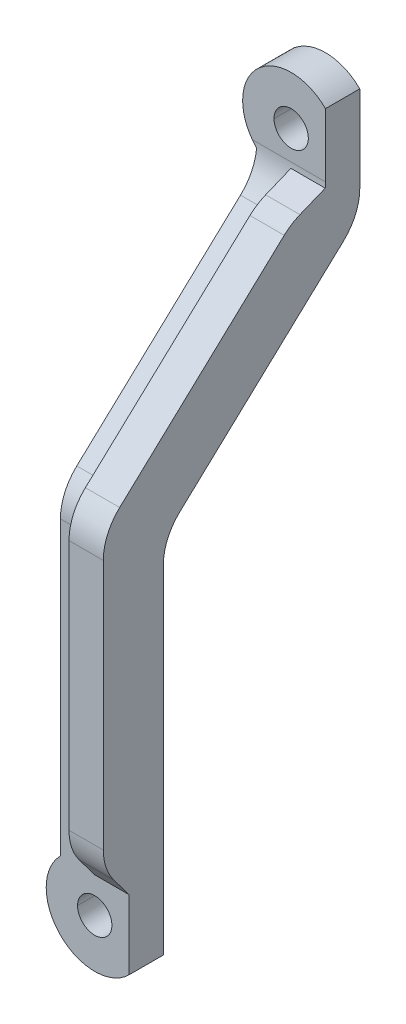
ISO-10303-21;
HEADER;
FILE_DESCRIPTION(('STEP AP214'),'2;1');
FILE_NAME('part.step','',(''),(''),'','','');
FILE_SCHEMA(('AUTOMOTIVE_DESIGN { 1 0 10303 214 1 1 1 1 }'));
ENDSEC;
DATA;
#1=APPLICATION_CONTEXT('core data for automotive mechanical design processes');
#2=APPLICATION_PROTOCOL_DEFINITION('international standard','automotive_design',2000,#1);
#3=PRODUCT_CONTEXT('',#1,'mechanical');
#4=PRODUCT('Part','Part','',(#3));
#5=PRODUCT_RELATED_PRODUCT_CATEGORY('part','',(#4));
#6=PRODUCT_DEFINITION_FORMATION('','',#4);
#7=PRODUCT_DEFINITION_CONTEXT('part definition',#1,'design');
#8=PRODUCT_DEFINITION('design','',#6,#7);
#9=PRODUCT_DEFINITION_SHAPE('','',#8);
#10=(LENGTH_UNIT() NAMED_UNIT(*) SI_UNIT(.MILLI.,.METRE.));
#11=(NAMED_UNIT(*) PLANE_ANGLE_UNIT() SI_UNIT($,.RADIAN.));
#12=(NAMED_UNIT(*) SI_UNIT($,.STERADIAN.) SOLID_ANGLE_UNIT());
#13=UNCERTAINTY_MEASURE_WITH_UNIT(LENGTH_MEASURE(1.E-05),#10,'distance_accuracy_value','');
#14=(GEOMETRIC_REPRESENTATION_CONTEXT(3) GLOBAL_UNCERTAINTY_ASSIGNED_CONTEXT((#13)) GLOBAL_UNIT_ASSIGNED_CONTEXT((#10,
#11,#12)) REPRESENTATION_CONTEXT('',''));
#15=CARTESIAN_POINT('',(0.,0.,0.));
#16=DIRECTION('',(0.,0.,1.));
#17=DIRECTION('',(1.,0.,0.));
#18=AXIS2_PLACEMENT_3D('',#15,#16,#17);
#19=CARTESIAN_POINT('',(2.,30.6154164817218,-9.0922660270173));
#20=DIRECTION('',(1.,0.,0.));
#21=DIRECTION('',(0.,1.,0.));
#22=AXIS2_PLACEMENT_3D('',#19,#20,#21);
#23=CYLINDRICAL_SURFACE('',#22,3.);
#24=CARTESIAN_POINT('',(2.,30.6154164817218,-9.0922660270173));
#25=DIRECTION('',(-1.,0.,0.));
#26=DIRECTION('',(0.,1.,0.));
#27=AXIS2_PLACEMENT_3D('',#24,#25,#26);
#28=CIRCLE('',#27,3.);
#29=CARTESIAN_POINT('',(2.,32.8094775865793,-7.04627094682981));
#30=VERTEX_POINT('',#29);
#31=CARTESIAN_POINT('',(2.,33.394070033702,-7.9612998745319));
#32=VERTEX_POINT('',#31);
#33=EDGE_CURVE('E9',#30,#32,#28,.T.);
#34=ORIENTED_EDGE('',*,*,#33,.F.);
#35=DIRECTION('',(-1.,0.,0.));
#36=VECTOR('',#35,1.);
#37=CARTESIAN_POINT('',(2.,32.8094775865793,-7.0462709468298));
#38=LINE('',#37,#36);
#39=CARTESIAN_POINT('',(4.,32.8094775865793,-7.04627094682981));
#40=VERTEX_POINT('',#39);
#41=EDGE_CURVE('E227',#40,#30,#38,.T.);
#42=ORIENTED_EDGE('',*,*,#41,.F.);
#43=CARTESIAN_POINT('',(4.,30.6154164817218,-9.0922660270173));
#44=DIRECTION('',(1.,0.,0.));
#45=DIRECTION('',(0.,1.,0.));
#46=AXIS2_PLACEMENT_3D('',#43,#44,#45);
#47=CIRCLE('',#46,3.);
#48=CARTESIAN_POINT('',(4.,33.394070033702,-7.9612998745319));
#49=VERTEX_POINT('',#48);
#50=EDGE_CURVE('E230',#49,#40,#47,.T.);
#51=ORIENTED_EDGE('',*,*,#50,.F.);
#52=DIRECTION('',(1.,0.,0.));
#53=VECTOR('',#52,1.);
#54=CARTESIAN_POINT('',(2.,33.394070033702,-7.9612998745319));
#55=LINE('',#54,#53);
#56=EDGE_CURVE('E418',#32,#49,#55,.T.);
#57=ORIENTED_EDGE('',*,*,#56,.F.);
#58=EDGE_LOOP('',(#34,#42,#51,#57));
#59=FACE_BOUND('',#58,.T.);
#60=ADVANCED_FACE('F14',(#59),#23,.T.);
#61=CARTESIAN_POINT('',(2.,21.6704837012824,0.5));
#62=DIRECTION('',(1.,0.,0.));
#63=DIRECTION('',(0.,1.,0.));
#64=AXIS2_PLACEMENT_3D('',#61,#62,#63);
#65=CYLINDRICAL_SURFACE('',#64,3.);
#66=CARTESIAN_POINT('',(2.,21.6704837012824,0.5));
#67=DIRECTION('',(-1.,0.,0.));
#68=DIRECTION('',(0.,1.,0.));
#69=AXIS2_PLACEMENT_3D('',#66,#67,#68);
#70=CIRCLE('',#69,3.);
#71=CARTESIAN_POINT('',(2.,21.6704837012824,3.5));
#72=VERTEX_POINT('',#71);
#73=CARTESIAN_POINT('',(2.,23.8645448061399,2.54599508018749));
#74=VERTEX_POINT('',#73);
#75=EDGE_CURVE('E25',#72,#74,#70,.T.);
#76=ORIENTED_EDGE('',*,*,#75,.F.);
#77=DIRECTION('',(-1.,0.,0.));
#78=VECTOR('',#77,1.);
#79=CARTESIAN_POINT('',(2.,21.6704837012824,3.5));
#80=LINE('',#79,#78);
#81=CARTESIAN_POINT('',(4.,21.6704837012824,3.5));
#82=VERTEX_POINT('',#81);
#83=EDGE_CURVE('E401',#82,#72,#80,.T.);
#84=ORIENTED_EDGE('',*,*,#83,.F.);
#85=CARTESIAN_POINT('',(4.,21.6704837012824,0.5));
#86=DIRECTION('',(1.,0.,0.));
#87=DIRECTION('',(0.,1.,0.));
#88=AXIS2_PLACEMENT_3D('',#85,#86,#87);
#89=CIRCLE('',#88,3.);
#90=CARTESIAN_POINT('',(4.,23.8645448061399,2.54599508018749));
#91=VERTEX_POINT('',#90);
#92=EDGE_CURVE('E246',#91,#82,#89,.T.);
#93=ORIENTED_EDGE('',*,*,#92,.F.);
#94=DIRECTION('',(1.,0.,0.));
#95=VECTOR('',#94,1.);
#96=CARTESIAN_POINT('',(2.,23.8645448061399,2.54599508018749));
#97=LINE('',#96,#95);
#98=EDGE_CURVE('E236',#74,#91,#97,.T.);
#99=ORIENTED_EDGE('',*,*,#98,.F.);
#100=EDGE_LOOP('',(#76,#84,#93,#99));
#101=FACE_BOUND('',#100,.T.);
#102=ADVANCED_FACE('F806',(#101),#65,.T.);
#103=CARTESIAN_POINT('',(2.,7.04848459707165,0.5));
#104=DIRECTION('',(1.,0.,0.));
#105=DIRECTION('',(0.,1.,0.));
#106=AXIS2_PLACEMENT_3D('',#103,#104,#105);
#107=CYLINDRICAL_SURFACE('',#106,3.);
#108=CARTESIAN_POINT('',(2.,7.04848459707165,0.5));
#109=DIRECTION('',(-1.,0.,0.));
#110=DIRECTION('',(0.,1.,0.));
#111=AXIS2_PLACEMENT_3D('',#108,#109,#110);
#112=CIRCLE('',#111,3.);
#113=CARTESIAN_POINT('',(2.,5.24848459707165,2.9));
#114=VERTEX_POINT('',#113);
#115=CARTESIAN_POINT('',(2.,7.04848459707165,3.5));
#116=VERTEX_POINT('',#115);
#117=EDGE_CURVE('E302',#114,#116,#112,.T.);
#118=ORIENTED_EDGE('',*,*,#117,.F.);
#119=DIRECTION('',(-1.,0.,0.));
#120=VECTOR('',#119,1.);
#121=CARTESIAN_POINT('',(2.,5.24848459707165,2.9));
#122=LINE('',#121,#120);
#123=CARTESIAN_POINT('',(4.,5.24848459707165,2.9));
#124=VERTEX_POINT('',#123);
#125=EDGE_CURVE('E337',#124,#114,#122,.T.);
#126=ORIENTED_EDGE('',*,*,#125,.F.);
#127=CARTESIAN_POINT('',(4.,7.04848459707165,0.5));
#128=DIRECTION('',(1.,0.,0.));
#129=DIRECTION('',(0.,1.,0.));
#130=AXIS2_PLACEMENT_3D('',#127,#128,#129);
#131=CIRCLE('',#130,3.);
#132=CARTESIAN_POINT('',(4.,7.04848459707165,3.5));
#133=VERTEX_POINT('',#132);
#134=EDGE_CURVE('E387',#133,#124,#131,.T.);
#135=ORIENTED_EDGE('',*,*,#134,.F.);
#136=DIRECTION('',(1.,0.,0.));
#137=VECTOR('',#136,1.);
#138=CARTESIAN_POINT('',(2.,7.04848459707165,3.5));
#139=LINE('',#138,#137);
#140=EDGE_CURVE('E470',#116,#133,#139,.T.);
#141=ORIENTED_EDGE('',*,*,#140,.F.);
#142=EDGE_LOOP('',(#118,#126,#135,#141));
#143=FACE_BOUND('',#142,.T.);
#144=ADVANCED_FACE('F810',(#143),#107,.T.);
#145=CARTESIAN_POINT('',(0.,34.3044371248828,-6.45));
#146=DIRECTION('',(-1.,0.,0.));
#147=DIRECTION('',(0.,0.,1.));
#148=AXIS2_PLACEMENT_3D('',#145,#146,#147);
#149=CYLINDRICAL_SURFACE('',#148,3.);
#150=CARTESIAN_POINT('',(4.,34.3044371248828,-6.45));
#151=DIRECTION('',(-1.,0.,0.));
#152=DIRECTION('',(0.,1.,0.));
#153=AXIS2_PLACEMENT_3D('',#150,#151,#152);
#154=CIRCLE('',#153,3.);
#155=CARTESIAN_POINT('',(4.,34.3044371248828,-9.45));
#156=VERTEX_POINT('',#155);
#157=CARTESIAN_POINT('',(4.,33.9934203426467,-9.43383453984425));
#158=VERTEX_POINT('',#157);
#159=EDGE_CURVE('E260',#156,#158,#154,.T.);
#160=ORIENTED_EDGE('',*,*,#159,.F.);
#161=DIRECTION('',(1.,0.,0.));
#162=VECTOR('',#161,1.);
#163=CARTESIAN_POINT('',(2.,34.3044371248828,-9.45));
#164=LINE('',#163,#162);
#165=CARTESIAN_POINT('',(-0.263860979946466,34.3044371248828,-9.45));
#166=VERTEX_POINT('',#165);
#167=EDGE_CURVE('E406',#166,#156,#164,.T.);
#168=ORIENTED_EDGE('',*,*,#167,.F.);
#169=CARTESIAN_POINT('',(0.,34.,-9.43451303180152));
#170=CARTESIAN_POINT('',(-0.0950755922492341,34.0950755922493,-9.44421127725814));
#171=CARTESIAN_POINT('',(-0.18303359615477,34.1965190034362,-9.45));
#172=CARTESIAN_POINT('',(-0.263860979946466,34.3044371248828,-9.45));
#173=(BOUNDED_CURVE() B_SPLINE_CURVE(3,(#169,#170,#171,#172),.UNSPECIFIED.,.F.,
.F.) B_SPLINE_CURVE_WITH_KNOTS((4,4),(0.,0.000403167987232583),
.UNSPECIFIED.) CURVE() GEOMETRIC_REPRESENTATION_ITEM() RATIONAL_B_SPLINE_CURVE((1.,1.,1.,1.)) REPRESENTATION_ITEM(''));
#174=CARTESIAN_POINT('',(0.,34.,-9.43451303180152));
#175=VERTEX_POINT('',#174);
#176=EDGE_CURVE('E391',#175,#166,#173,.T.);
#177=ORIENTED_EDGE('',*,*,#176,.F.);
#178=CARTESIAN_POINT('',(0.,34.3044371248828,-6.45));
#179=DIRECTION('',(1.,0.,0.));
#180=DIRECTION('',(0.,-1.,0.));
#181=AXIS2_PLACEMENT_3D('',#178,#179,#180);
#182=CIRCLE('',#181,3.);
#183=CARTESIAN_POINT('',(0.,32.1103760200253,-8.4959950801875));
#184=VERTEX_POINT('',#183);
#185=EDGE_CURVE('E374',#184,#175,#182,.T.);
#186=ORIENTED_EDGE('',*,*,#185,.F.);
#187=DIRECTION('',(-1.,0.,0.));
#188=VECTOR('',#187,1.);
#189=CARTESIAN_POINT('',(0.,32.1103760200253,-8.49599508018749));
#190=LINE('',#189,#188);
#191=CARTESIAN_POINT('',(2.,32.1103760200253,-8.49599508018747));
#192=VERTEX_POINT('',#191);
#193=EDGE_CURVE('E410',#192,#184,#190,.T.);
#194=ORIENTED_EDGE('',*,*,#193,.F.);
#195=CARTESIAN_POINT('',(2.,34.3044371248828,-6.45));
#196=DIRECTION('',(-1.,0.,0.));
#197=DIRECTION('',(0.,1.,0.));
#198=AXIS2_PLACEMENT_3D('',#195,#196,#197);
#199=CIRCLE('',#198,3.);
#200=CARTESIAN_POINT('',(2.,33.9934203426467,-9.43383453984425));
#201=VERTEX_POINT('',#200);
#202=EDGE_CURVE('E414',#201,#192,#199,.T.);
#203=ORIENTED_EDGE('',*,*,#202,.F.);
#204=DIRECTION('',(-1.,0.,0.));
#205=VECTOR('',#204,1.);
#206=CARTESIAN_POINT('',(4.,33.9934203426467,-9.43383453984425));
#207=LINE('',#206,#205);
#208=EDGE_CURVE('E235',#158,#201,#207,.T.);
#209=ORIENTED_EDGE('',*,*,#208,.F.);
#210=EDGE_LOOP('',(#160,#168,#177,#186,#194,#203,#209));
#211=FACE_BOUND('',#210,.T.);
#212=ADVANCED_FACE('F869',(#211),#149,.F.);
#213=CARTESIAN_POINT('',(0.,21.0182651388409,-1.));
#214=DIRECTION('',(1.,0.,0.));
#215=DIRECTION('',(0.,0.,-1.));
#216=AXIS2_PLACEMENT_3D('',#213,#214,#215);
#217=CYLINDRICAL_SURFACE('',#216,3.);
#218=CARTESIAN_POINT('',(2.,21.0182651388409,-1.));
#219=DIRECTION('',(1.,0.,0.));
#220=DIRECTION('',(0.,1.,0.));
#221=AXIS2_PLACEMENT_3D('',#218,#219,#220);
#222=CIRCLE('',#221,3.);
#223=CARTESIAN_POINT('',(2.,23.2123262436985,1.04599508018749));
#224=VERTEX_POINT('',#223);
#225=CARTESIAN_POINT('',(2.,21.0182651388409,2.));
#226=VERTEX_POINT('',#225);
#227=EDGE_CURVE('E306',#224,#226,#222,.T.);
#228=ORIENTED_EDGE('',*,*,#227,.F.);
#229=DIRECTION('',(1.,0.,0.));
#230=VECTOR('',#229,1.);
#231=CARTESIAN_POINT('',(0.,23.2123262436985,1.04599508018749));
#232=LINE('',#231,#230);
#233=CARTESIAN_POINT('',(0.,23.2123262436985,1.04599508018749));
#234=VERTEX_POINT('',#233);
#235=EDGE_CURVE('E279',#234,#224,#232,.T.);
#236=ORIENTED_EDGE('',*,*,#235,.F.);
#237=CARTESIAN_POINT('',(0.,21.0182651388409,-1.));
#238=DIRECTION('',(-1.,0.,0.));
#239=DIRECTION('',(0.,-1.,0.));
#240=AXIS2_PLACEMENT_3D('',#237,#238,#239);
#241=CIRCLE('',#240,3.);
#242=CARTESIAN_POINT('',(0.,21.0182651388409,2.));
#243=VERTEX_POINT('',#242);
#244=EDGE_CURVE('E378',#243,#234,#241,.T.);
#245=ORIENTED_EDGE('',*,*,#244,.F.);
#246=DIRECTION('',(-1.,0.,0.));
#247=VECTOR('',#246,1.);
#248=CARTESIAN_POINT('',(0.,21.0182651388409,2.));
#249=LINE('',#248,#247);
#250=EDGE_CURVE('E264',#226,#243,#249,.T.);
#251=ORIENTED_EDGE('',*,*,#250,.F.);
#252=EDGE_LOOP('',(#228,#236,#245,#251));
#253=FACE_BOUND('',#252,.T.);
#254=ADVANCED_FACE('F16',(#253),#217,.T.);
#255=CARTESIAN_POINT('',(0.,32.9817348611591,-8.45));
#256=DIRECTION('',(-1.,0.,0.));
#257=DIRECTION('',(0.,0.,1.));
#258=AXIS2_PLACEMENT_3D('',#255,#256,#257);
#259=CYLINDRICAL_SURFACE('',#258,3.);
#260=CARTESIAN_POINT('',(4.,32.9817348611591,-8.45));
#261=DIRECTION('',(1.,0.,0.));
#262=DIRECTION('',(0.,1.,0.));
#263=AXIS2_PLACEMENT_3D('',#260,#261,#262);
#264=CIRCLE('',#263,3.);
#265=CARTESIAN_POINT('',(4.,30.7876737563015,-10.4959950801875));
#266=VERTEX_POINT('',#265);
#267=CARTESIAN_POINT('',(4.,32.9817348611591,-11.45));
#268=VERTEX_POINT('',#267);
#269=EDGE_CURVE('E348',#266,#268,#264,.T.);
#270=ORIENTED_EDGE('',*,*,#269,.F.);
#271=DIRECTION('',(1.,0.,0.));
#272=VECTOR('',#271,1.);
#273=CARTESIAN_POINT('',(4.,30.7876737563015,-10.4959950801875));
#274=LINE('',#273,#272);
#275=CARTESIAN_POINT('',(0.,30.7876737563015,-10.4959950801875));
#276=VERTEX_POINT('',#275);
#277=EDGE_CURVE('E342',#276,#266,#274,.T.);
#278=ORIENTED_EDGE('',*,*,#277,.F.);
#279=CARTESIAN_POINT('',(0.,32.9817348611591,-8.45));
#280=DIRECTION('',(-1.,0.,0.));
#281=DIRECTION('',(0.,-1.,0.));
#282=AXIS2_PLACEMENT_3D('',#279,#280,#281);
#283=CIRCLE('',#282,3.);
#284=CARTESIAN_POINT('',(0.,32.9817348611591,-11.45));
#285=VERTEX_POINT('',#284);
#286=EDGE_CURVE('E358',#285,#276,#283,.T.);
#287=ORIENTED_EDGE('',*,*,#286,.F.);
#288=DIRECTION('',(-1.,0.,0.));
#289=VECTOR('',#288,1.);
#290=CARTESIAN_POINT('',(0.,32.9817348611591,-11.45));
#291=LINE('',#290,#289);
#292=EDGE_CURVE('E208',#268,#285,#291,.T.);
#293=ORIENTED_EDGE('',*,*,#292,.F.);
#294=EDGE_LOOP('',(#270,#278,#287,#293));
#295=FACE_BOUND('',#294,.T.);
#296=ADVANCED_FACE('F557',(#295),#259,.T.);
#297=CARTESIAN_POINT('',(0.,19.6955628751173,-3.));
#298=DIRECTION('',(1.,0.,0.));
#299=DIRECTION('',(0.,0.,-1.));
#300=AXIS2_PLACEMENT_3D('',#297,#298,#299);
#301=CYLINDRICAL_SURFACE('',#300,3.);
#302=CARTESIAN_POINT('',(4.,19.6955628751173,-3.));
#303=DIRECTION('',(-1.,0.,0.));
#304=DIRECTION('',(0.,1.,0.));
#305=AXIS2_PLACEMENT_3D('',#302,#303,#304);
#306=CIRCLE('',#305,3.);
#307=CARTESIAN_POINT('',(4.,19.6955628751173,0.));
#308=VERTEX_POINT('',#307);
#309=CARTESIAN_POINT('',(4.,21.8896239799747,-0.954004919812507));
#310=VERTEX_POINT('',#309);
#311=EDGE_CURVE('E277',#308,#310,#306,.T.);
#312=ORIENTED_EDGE('',*,*,#311,.F.);
#313=DIRECTION('',(1.,0.,0.));
#314=VECTOR('',#313,1.);
#315=CARTESIAN_POINT('',(0.,19.6955628751173,0.));
#316=LINE('',#315,#314);
#317=CARTESIAN_POINT('',(0.,19.6955628751173,0.));
#318=VERTEX_POINT('',#317);
#319=EDGE_CURVE('E350',#318,#308,#316,.T.);
#320=ORIENTED_EDGE('',*,*,#319,.F.);
#321=CARTESIAN_POINT('',(0.,19.6955628751173,-3.));
#322=DIRECTION('',(1.,0.,0.));
#323=DIRECTION('',(0.,-1.,0.));
#324=AXIS2_PLACEMENT_3D('',#321,#322,#323);
#325=CIRCLE('',#324,3.);
#326=CARTESIAN_POINT('',(0.,21.8896239799747,-0.954004919812507));
#327=VERTEX_POINT('',#326);
#328=EDGE_CURVE('E296',#327,#318,#325,.T.);
#329=ORIENTED_EDGE('',*,*,#328,.F.);
#330=DIRECTION('',(-1.,0.,0.));
#331=VECTOR('',#330,1.);
#332=CARTESIAN_POINT('',(0.,21.8896239799747,-0.954004919812507));
#333=LINE('',#332,#331);
#334=EDGE_CURVE('E402',#310,#327,#333,.T.);
#335=ORIENTED_EDGE('',*,*,#334,.F.);
#336=EDGE_LOOP('',(#312,#320,#329,#335));
#337=FACE_BOUND('',#336,.T.);
#338=ADVANCED_FACE('F552',(#337),#301,.F.);
#339=CARTESIAN_POINT('',(2.,0.,0.));
#340=DIRECTION('',(1.,0.,0.));
#341=DIRECTION('',(0.,-1.,0.));
#342=AXIS2_PLACEMENT_3D('',#339,#340,#341);
#343=PLANE('',#342);
#344=DIRECTION('',(0.,-0.376988717495132,0.926217850660078));
#345=VECTOR('',#344,1.);
#346=CARTESIAN_POINT('',(2.,33.1859610193725,-7.45));
#347=LINE('',#346,#345);
#348=EDGE_CURVE('E421',#201,#32,#347,.T.);
#349=ORIENTED_EDGE('',*,*,#348,.F.);
#350=ORIENTED_EDGE('',*,*,#202,.T.);
#351=DIRECTION('',(0.,0.681998360062499,-0.73135370161917));
#352=VECTOR('',#351,1.);
#353=CARTESIAN_POINT('',(2.,33.,-9.45));
#354=LINE('',#353,#352);
#355=EDGE_CURVE('E283',#224,#192,#354,.T.);
#356=ORIENTED_EDGE('',*,*,#355,.F.);
#357=ORIENTED_EDGE('',*,*,#227,.T.);
#358=DIRECTION('',(0.,1.,0.));
#359=VECTOR('',#358,1.);
#360=CARTESIAN_POINT('',(2.,22.3227022637238,2.));
#361=LINE('',#360,#359);
#362=CARTESIAN_POINT('',(2.,4.04848459707165,2.));
#363=VERTEX_POINT('',#362);
#364=EDGE_CURVE('E271',#363,#226,#361,.T.);
#365=ORIENTED_EDGE('',*,*,#364,.F.);
#366=DIRECTION('',(0.,-0.8,-0.6));
#367=VECTOR('',#366,1.);
#368=CARTESIAN_POINT('',(2.,4.04848459707165,2.));
#369=LINE('',#368,#367);
#370=EDGE_CURVE('E341',#114,#363,#369,.T.);
#371=ORIENTED_EDGE('',*,*,#370,.F.);
#372=ORIENTED_EDGE('',*,*,#117,.T.);
#373=DIRECTION('',(0.,-1.,0.));
#374=VECTOR('',#373,1.);
#375=CARTESIAN_POINT('',(2.,6.04848459707165,3.5));
#376=LINE('',#375,#374);
#377=EDGE_CURVE('E473',#72,#116,#376,.T.);
#378=ORIENTED_EDGE('',*,*,#377,.F.);
#379=ORIENTED_EDGE('',*,*,#75,.T.);
#380=DIRECTION('',(0.,-0.681998360062499,0.73135370161917));
#381=VECTOR('',#380,1.);
#382=CARTESIAN_POINT('',(2.,22.9749208261651,3.5));
#383=LINE('',#382,#381);
#384=EDGE_CURVE('E398',#30,#74,#383,.T.);
#385=ORIENTED_EDGE('',*,*,#384,.F.);
#386=ORIENTED_EDGE('',*,*,#33,.T.);
#387=EDGE_LOOP('',(#349,#350,#356,#357,#365,#371,#372,#378,#379,#385,#386));
#388=FACE_BOUND('',#387,.T.);
#389=ADVANCED_FACE('F921',(#388),#343,.F.);
#390=CARTESIAN_POINT('',(2.,33.1859610193725,-7.45));
#391=DIRECTION('',(0.,0.926217850660078,0.376988717495132));
#392=DIRECTION('',(1.,0.,0.));
#393=AXIS2_PLACEMENT_3D('',#390,#391,#392);
#394=PLANE('',#393);
#395=DIRECTION('',(0.,-0.376988717495132,0.926217850660078));
#396=VECTOR('',#395,1.);
#397=CARTESIAN_POINT('',(4.,33.1859610193725,-7.45));
#398=LINE('',#397,#396);
#399=EDGE_CURVE('E252',#158,#49,#398,.T.);
#400=ORIENTED_EDGE('',*,*,#399,.F.);
#401=ORIENTED_EDGE('',*,*,#208,.T.);
#402=ORIENTED_EDGE('',*,*,#348,.T.);
#403=ORIENTED_EDGE('',*,*,#56,.T.);
#404=EDGE_LOOP('',(#400,#401,#402,#403));
#405=FACE_BOUND('',#404,.T.);
#406=ADVANCED_FACE('F913',(#405),#394,.T.);
#407=CARTESIAN_POINT('',(2.,22.9749208261651,3.5));
#408=DIRECTION('',(0.,0.73135370161917,0.681998360062499));
#409=DIRECTION('',(1.,0.,0.));
#410=AXIS2_PLACEMENT_3D('',#407,#408,#409);
#411=PLANE('',#410);
#412=ORIENTED_EDGE('',*,*,#384,.T.);
#413=ORIENTED_EDGE('',*,*,#98,.T.);
#414=DIRECTION('',(0.,-0.681998360062499,0.73135370161917));
#415=VECTOR('',#414,1.);
#416=CARTESIAN_POINT('',(4.,22.9749208261651,3.5));
#417=LINE('',#416,#415);
#418=EDGE_CURVE('E239',#40,#91,#417,.T.);
#419=ORIENTED_EDGE('',*,*,#418,.F.);
#420=ORIENTED_EDGE('',*,*,#41,.T.);
#421=EDGE_LOOP('',(#412,#413,#419,#420));
#422=FACE_BOUND('',#421,.T.);
#423=ADVANCED_FACE('F240',(#422),#411,.T.);
#424=CARTESIAN_POINT('',(2.,6.04848459707165,3.5));
#425=DIRECTION('',(0.,0.,1.));
#426=DIRECTION('',(1.,0.,0.));
#427=AXIS2_PLACEMENT_3D('',#424,#425,#426);
#428=PLANE('',#427);
#429=ORIENTED_EDGE('',*,*,#377,.T.);
#430=ORIENTED_EDGE('',*,*,#140,.T.);
#431=DIRECTION('',(0.,-1.,0.));
#432=VECTOR('',#431,1.);
#433=CARTESIAN_POINT('',(4.,6.04848459707165,3.5));
#434=LINE('',#433,#432);
#435=EDGE_CURVE('E394',#82,#133,#434,.T.);
#436=ORIENTED_EDGE('',*,*,#435,.F.);
#437=ORIENTED_EDGE('',*,*,#83,.T.);
#438=EDGE_LOOP('',(#429,#430,#436,#437));
#439=FACE_BOUND('',#438,.T.);
#440=ADVANCED_FACE('F912',(#439),#428,.T.);
#441=CARTESIAN_POINT('',(2.,4.04848459707165,2.));
#442=DIRECTION('',(0.,-0.6,0.8));
#443=DIRECTION('',(-1.,0.,0.));
#444=AXIS2_PLACEMENT_3D('',#441,#442,#443);
#445=PLANE('',#444);
#446=DIRECTION('',(0.,-0.8,-0.6));
#447=VECTOR('',#446,1.);
#448=CARTESIAN_POINT('',(4.,4.04848459707165,2.));
#449=LINE('',#448,#447);
#450=CARTESIAN_POINT('',(4.,4.04848459707165,2.));
#451=VERTEX_POINT('',#450);
#452=EDGE_CURVE('E270',#124,#451,#449,.T.);
#453=ORIENTED_EDGE('',*,*,#452,.F.);
#454=ORIENTED_EDGE('',*,*,#125,.T.);
#455=ORIENTED_EDGE('',*,*,#370,.T.);
#456=DIRECTION('',(1.,0.,0.));
#457=VECTOR('',#456,1.);
#458=CARTESIAN_POINT('',(2.,4.04848459707165,2.));
#459=LINE('',#458,#457);
#460=EDGE_CURVE('E397',#363,#451,#459,.T.);
#461=ORIENTED_EDGE('',*,*,#460,.T.);
#462=EDGE_LOOP('',(#453,#454,#455,#461));
#463=FACE_BOUND('',#462,.T.);
#464=ADVANCED_FACE('F945',(#463),#445,.T.);
#465=CARTESIAN_POINT('',(0.,31.6772977362763,-11.45));
#466=DIRECTION('',(0.,0.731353701619172,0.681998360062497));
#467=DIRECTION('',(1.,0.,0.));
#468=AXIS2_PLACEMENT_3D('',#465,#466,#467);
#469=PLANE('',#468);
#470=DIRECTION('',(0.,0.681998360062497,-0.731353701619172));
#471=VECTOR('',#470,1.);
#472=CARTESIAN_POINT('',(4.,10.2348789240535,11.5441790014723));
#473=LINE('',#472,#471);
#474=EDGE_CURVE('E407',#310,#266,#473,.T.);
#475=ORIENTED_EDGE('',*,*,#474,.F.);
#476=ORIENTED_EDGE('',*,*,#334,.T.);
#477=DIRECTION('',(0.,-0.681998360062497,0.731353701619172));
#478=VECTOR('',#477,1.);
#479=CARTESIAN_POINT('',(0.,10.2348789240535,11.5441790014723));
#480=LINE('',#479,#478);
#481=EDGE_CURVE('E301',#276,#327,#480,.T.);
#482=ORIENTED_EDGE('',*,*,#481,.F.);
#483=ORIENTED_EDGE('',*,*,#277,.T.);
#484=EDGE_LOOP('',(#475,#476,#482,#483));
#485=FACE_BOUND('',#484,.T.);
#486=ADVANCED_FACE('F549',(#485),#469,.F.);
#487=CARTESIAN_POINT('',(0.,0.,-9.45));
#488=DIRECTION('',(0.,0.,1.));
#489=DIRECTION('',(1.,0.,0.));
#490=AXIS2_PLACEMENT_3D('',#487,#488,#489);
#491=PLANE('',#490);
#492=CARTESIAN_POINT('',(2.,36.,-9.45));
#493=DIRECTION('',(0.,0.,-1.));
#494=DIRECTION('',(1.,0.,0.));
#495=AXIS2_PLACEMENT_3D('',#492,#493,#494);
#496=CIRCLE('',#495,1.);
#497=CARTESIAN_POINT('',(1.,36.,-9.45));
#498=VERTEX_POINT('',#497);
#499=CARTESIAN_POINT('',(3.,36.,-9.45));
#500=VERTEX_POINT('',#499);
#501=EDGE_CURVE('E377',#498,#500,#496,.T.);
#502=ORIENTED_EDGE('',*,*,#501,.T.);
#503=CARTESIAN_POINT('',(2.,36.,-9.45));
#504=DIRECTION('',(0.,0.,-1.));
#505=DIRECTION('',(1.,0.,0.));
#506=AXIS2_PLACEMENT_3D('',#503,#504,#505);
#507=CIRCLE('',#506,1.);
#508=EDGE_CURVE('E332',#500,#498,#507,.T.);
#509=ORIENTED_EDGE('',*,*,#508,.T.);
#510=EDGE_LOOP('',(#502,#509));
#511=FACE_BOUND('',#510,.T.);
#512=CARTESIAN_POINT('',(2.,36.,-9.45));
#513=DIRECTION('',(0.,0.,1.));
#514=DIRECTION('',(1.,0.,0.));
#515=AXIS2_PLACEMENT_3D('',#512,#513,#514);
#516=CIRCLE('',#515,2.82842712474619);
#517=CARTESIAN_POINT('',(4.,38.,-9.45));
#518=VERTEX_POINT('',#517);
#519=CARTESIAN_POINT('',(-0.828427124746193,36.,-9.45));
#520=VERTEX_POINT('',#519);
#521=EDGE_CURVE('E336',#518,#520,#516,.T.);
#522=ORIENTED_EDGE('',*,*,#521,.T.);
#523=CARTESIAN_POINT('',(2.,36.,-9.45));
#524=DIRECTION('',(0.,0.,1.));
#525=DIRECTION('',(1.,0.,0.));
#526=AXIS2_PLACEMENT_3D('',#523,#524,#525);
#527=CIRCLE('',#526,2.82842712474619);
#528=EDGE_CURVE('E320',#520,#166,#527,.T.);
#529=ORIENTED_EDGE('',*,*,#528,.T.);
#530=ORIENTED_EDGE('',*,*,#167,.T.);
#531=DIRECTION('',(0.,1.,0.));
#532=VECTOR('',#531,1.);
#533=CARTESIAN_POINT('',(4.,0.,-9.45));
#534=LINE('',#533,#532);
#535=EDGE_CURVE('E285',#156,#518,#534,.T.);
#536=ORIENTED_EDGE('',*,*,#535,.T.);
#537=EDGE_LOOP('',(#522,#529,#530,#536));
#538=FACE_BOUND('',#537,.T.);
#539=ADVANCED_FACE('F900',(#511,#538),#491,.T.);
#540=CARTESIAN_POINT('',(0.,0.,-11.45));
#541=DIRECTION('',(0.,0.,1.));
#542=DIRECTION('',(1.,0.,0.));
#543=AXIS2_PLACEMENT_3D('',#540,#541,#542);
#544=PLANE('',#543);
#545=CARTESIAN_POINT('',(2.,36.,-11.45));
#546=DIRECTION('',(0.,0.,-1.));
#547=DIRECTION('',(1.,0.,0.));
#548=AXIS2_PLACEMENT_3D('',#545,#546,#547);
#549=CIRCLE('',#548,1.);
#550=CARTESIAN_POINT('',(1.,36.,-11.45));
#551=VERTEX_POINT('',#550);
#552=CARTESIAN_POINT('',(3.,36.,-11.45));
#553=VERTEX_POINT('',#552);
#554=EDGE_CURVE('E275',#551,#553,#549,.T.);
#555=ORIENTED_EDGE('',*,*,#554,.F.);
#556=CARTESIAN_POINT('',(2.,36.,-11.45));
#557=DIRECTION('',(0.,0.,-1.));
#558=DIRECTION('',(1.,0.,0.));
#559=AXIS2_PLACEMENT_3D('',#556,#557,#558);
#560=CIRCLE('',#559,1.);
#561=EDGE_CURVE('E366',#553,#551,#560,.T.);
#562=ORIENTED_EDGE('',*,*,#561,.F.);
#563=EDGE_LOOP('',(#555,#562));
#564=FACE_BOUND('',#563,.T.);
#565=DIRECTION('',(0.,1.,0.));
#566=VECTOR('',#565,1.);
#567=CARTESIAN_POINT('',(4.,0.,-11.45));
#568=LINE('',#567,#566);
#569=CARTESIAN_POINT('',(4.,38.,-11.45));
#570=VERTEX_POINT('',#569);
#571=EDGE_CURVE('E345',#268,#570,#568,.T.);
#572=ORIENTED_EDGE('',*,*,#571,.F.);
#573=ORIENTED_EDGE('',*,*,#292,.T.);
#574=DIRECTION('',(0.,-1.,0.));
#575=VECTOR('',#574,1.);
#576=CARTESIAN_POINT('',(0.,0.,-11.45));
#577=LINE('',#576,#575);
#578=CARTESIAN_POINT('',(0.,34.,-11.45));
#579=VERTEX_POINT('',#578);
#580=EDGE_CURVE('E361',#579,#285,#577,.T.);
#581=ORIENTED_EDGE('',*,*,#580,.F.);
#582=CARTESIAN_POINT('',(2.,36.,-11.45));
#583=DIRECTION('',(0.,0.,1.));
#584=DIRECTION('',(1.,0.,0.));
#585=AXIS2_PLACEMENT_3D('',#582,#583,#584);
#586=CIRCLE('',#585,2.82842712474619);
#587=CARTESIAN_POINT('',(-0.828427124746193,36.,-11.45));
#588=VERTEX_POINT('',#587);
#589=EDGE_CURVE('E307',#588,#579,#586,.T.);
#590=ORIENTED_EDGE('',*,*,#589,.F.);
#591=CARTESIAN_POINT('',(2.,36.,-11.45));
#592=DIRECTION('',(0.,0.,1.));
#593=DIRECTION('',(1.,0.,0.));
#594=AXIS2_PLACEMENT_3D('',#591,#592,#593);
#595=CIRCLE('',#594,2.82842712474619);
#596=EDGE_CURVE('E196',#570,#588,#595,.T.);
#597=ORIENTED_EDGE('',*,*,#596,.F.);
#598=EDGE_LOOP('',(#572,#573,#581,#590,#597));
#599=FACE_BOUND('',#598,.T.);
#600=ADVANCED_FACE('F527',(#564,#599),#544,.F.);
#601=CARTESIAN_POINT('',(2.,2.,2.));
#602=DIRECTION('',(0.,0.,-1.));
#603=DIRECTION('',(-1.,0.,0.));
#604=AXIS2_PLACEMENT_3D('',#601,#602,#603);
#605=CYLINDRICAL_SURFACE('',#604,1.);
#606=DIRECTION('',(0.,0.,-1.));
#607=VECTOR('',#606,1.);
#608=CARTESIAN_POINT('',(3.,2.,2.));
#609=LINE('',#608,#607);
#610=CARTESIAN_POINT('',(3.,2.,2.));
#611=VERTEX_POINT('',#610);
#612=CARTESIAN_POINT('',(3.,2.,0.));
#613=VERTEX_POINT('',#612);
#614=EDGE_CURVE('E425',#611,#613,#609,.T.);
#615=ORIENTED_EDGE('',*,*,#614,.F.);
#616=CARTESIAN_POINT('',(2.,2.,2.));
#617=DIRECTION('',(0.,0.,1.));
#618=DIRECTION('',(1.,0.,0.));
#619=AXIS2_PLACEMENT_3D('',#616,#617,#618);
#620=CIRCLE('',#619,1.);
#621=CARTESIAN_POINT('',(1.,2.,2.));
#622=VERTEX_POINT('',#621);
#623=EDGE_CURVE('E354',#611,#622,#620,.T.);
#624=ORIENTED_EDGE('',*,*,#623,.T.);
#625=DIRECTION('',(0.,0.,-1.));
#626=VECTOR('',#625,1.);
#627=CARTESIAN_POINT('',(1.,2.,2.));
#628=LINE('',#627,#626);
#629=CARTESIAN_POINT('',(1.,2.,0.));
#630=VERTEX_POINT('',#629);
#631=EDGE_CURVE('E316',#622,#630,#628,.T.);
#632=ORIENTED_EDGE('',*,*,#631,.T.);
#633=CARTESIAN_POINT('',(2.,2.,0.));
#634=DIRECTION('',(0.,0.,1.));
#635=DIRECTION('',(1.,0.,0.));
#636=AXIS2_PLACEMENT_3D('',#633,#634,#635);
#637=CIRCLE('',#636,1.);
#638=EDGE_CURVE('E417',#613,#630,#637,.T.);
#639=ORIENTED_EDGE('',*,*,#638,.F.);
#640=EDGE_LOOP('',(#615,#624,#632,#639));
#641=FACE_BOUND('',#640,.T.);
#642=ADVANCED_FACE('F816',(#641),#605,.F.);
#643=CARTESIAN_POINT('',(2.,2.,2.));
#644=DIRECTION('',(0.,0.,-1.));
#645=DIRECTION('',(-1.,0.,0.));
#646=AXIS2_PLACEMENT_3D('',#643,#644,#645);
#647=CYLINDRICAL_SURFACE('',#646,2.82842712474619);
#648=DIRECTION('',(0.,0.,-1.));
#649=VECTOR('',#648,1.);
#650=CARTESIAN_POINT('',(-0.828427124746189,2.,2.));
#651=LINE('',#650,#649);
#652=CARTESIAN_POINT('',(-0.828427124746189,2.,2.));
#653=VERTEX_POINT('',#652);
#654=CARTESIAN_POINT('',(-0.828427124746189,2.,0.));
#655=VERTEX_POINT('',#654);
#656=EDGE_CURVE('E290',#653,#655,#651,.T.);
#657=ORIENTED_EDGE('',*,*,#656,.F.);
#658=CARTESIAN_POINT('',(2.,2.,2.));
#659=DIRECTION('',(0.,0.,1.));
#660=DIRECTION('',(1.,0.,0.));
#661=AXIS2_PLACEMENT_3D('',#658,#659,#660);
#662=CIRCLE('',#661,2.82842712474619);
#663=CARTESIAN_POINT('',(0.,4.,2.));
#664=VERTEX_POINT('',#663);
#665=EDGE_CURVE('E18',#664,#653,#662,.T.);
#666=ORIENTED_EDGE('',*,*,#665,.F.);
#667=DIRECTION('',(0.,0.,-1.));
#668=VECTOR('',#667,1.);
#669=CARTESIAN_POINT('',(0.,4.,2.));
#670=LINE('',#669,#668);
#671=CARTESIAN_POINT('',(0.,4.,0.));
#672=VERTEX_POINT('',#671);
#673=EDGE_CURVE('E489',#664,#672,#670,.T.);
#674=ORIENTED_EDGE('',*,*,#673,.T.);
#675=CARTESIAN_POINT('',(2.,2.,0.));
#676=DIRECTION('',(0.,0.,1.));
#677=DIRECTION('',(1.,0.,0.));
#678=AXIS2_PLACEMENT_3D('',#675,#676,#677);
#679=CIRCLE('',#678,2.82842712474619);
#680=EDGE_CURVE('E353',#672,#655,#679,.T.);
#681=ORIENTED_EDGE('',*,*,#680,.T.);
#682=EDGE_LOOP('',(#657,#666,#674,#681));
#683=FACE_BOUND('',#682,.T.);
#684=ADVANCED_FACE('F820',(#683),#647,.T.);
#685=CARTESIAN_POINT('',(0.,0.,0.));
#686=DIRECTION('',(0.,0.,1.));
#687=DIRECTION('',(1.,0.,0.));
#688=AXIS2_PLACEMENT_3D('',#685,#686,#687);
#689=PLANE('',#688);
#690=CARTESIAN_POINT('',(2.,2.,0.));
#691=DIRECTION('',(0.,0.,1.));
#692=DIRECTION('',(1.,0.,0.));
#693=AXIS2_PLACEMENT_3D('',#690,#691,#692);
#694=CIRCLE('',#693,1.);
#695=EDGE_CURVE('E324',#630,#613,#694,.T.);
#696=ORIENTED_EDGE('',*,*,#695,.T.);
#697=ORIENTED_EDGE('',*,*,#638,.T.);
#698=EDGE_LOOP('',(#696,#697));
#699=FACE_BOUND('',#698,.T.);
#700=DIRECTION('',(0.,1.,0.));
#701=VECTOR('',#700,1.);
#702=CARTESIAN_POINT('',(0.,0.,0.));
#703=LINE('',#702,#701);
#704=EDGE_CURVE('E300',#672,#318,#703,.T.);
#705=ORIENTED_EDGE('',*,*,#704,.T.);
#706=ORIENTED_EDGE('',*,*,#319,.T.);
#707=DIRECTION('',(0.,-1.,0.));
#708=VECTOR('',#707,1.);
#709=CARTESIAN_POINT('',(4.,0.,0.));
#710=LINE('',#709,#708);
#711=CARTESIAN_POINT('',(4.,0.,0.));
#712=VERTEX_POINT('',#711);
#713=EDGE_CURVE('E269',#308,#712,#710,.T.);
#714=ORIENTED_EDGE('',*,*,#713,.T.);
#715=CARTESIAN_POINT('',(2.,2.,0.));
#716=DIRECTION('',(0.,0.,1.));
#717=DIRECTION('',(1.,0.,0.));
#718=AXIS2_PLACEMENT_3D('',#715,#716,#717);
#719=CIRCLE('',#718,2.82842712474619);
#720=EDGE_CURVE('E294',#655,#712,#719,.T.);
#721=ORIENTED_EDGE('',*,*,#720,.F.);
#722=ORIENTED_EDGE('',*,*,#680,.F.);
#723=EDGE_LOOP('',(#705,#706,#714,#721,#722));
#724=FACE_BOUND('',#723,.T.);
#725=ADVANCED_FACE('F562',(#699,#724),#689,.F.);
#726=CARTESIAN_POINT('',(0.,0.,2.));
#727=DIRECTION('',(0.,0.,1.));
#728=DIRECTION('',(1.,0.,0.));
#729=AXIS2_PLACEMENT_3D('',#726,#727,#728);
#730=PLANE('',#729);
#731=CARTESIAN_POINT('',(2.,2.,2.));
#732=DIRECTION('',(0.,0.,1.));
#733=DIRECTION('',(1.,0.,0.));
#734=AXIS2_PLACEMENT_3D('',#731,#732,#733);
#735=CIRCLE('',#734,1.);
#736=EDGE_CURVE('E477',#622,#611,#735,.T.);
#737=ORIENTED_EDGE('',*,*,#736,.F.);
#738=ORIENTED_EDGE('',*,*,#623,.F.);
#739=EDGE_LOOP('',(#737,#738));
#740=FACE_BOUND('',#739,.T.);
#741=ORIENTED_EDGE('',*,*,#364,.T.);
#742=ORIENTED_EDGE('',*,*,#250,.T.);
#743=DIRECTION('',(0.,1.,0.));
#744=VECTOR('',#743,1.);
#745=CARTESIAN_POINT('',(0.,0.,2.));
#746=LINE('',#745,#744);
#747=EDGE_CURVE('E465',#664,#243,#746,.T.);
#748=ORIENTED_EDGE('',*,*,#747,.F.);
#749=ORIENTED_EDGE('',*,*,#665,.T.);
#750=CARTESIAN_POINT('',(2.,2.,2.));
#751=DIRECTION('',(0.,0.,1.));
#752=DIRECTION('',(1.,0.,0.));
#753=AXIS2_PLACEMENT_3D('',#750,#751,#752);
#754=CIRCLE('',#753,2.82842712474619);
#755=CARTESIAN_POINT('',(4.,0.,2.));
#756=VERTEX_POINT('',#755);
#757=EDGE_CURVE('E295',#653,#756,#754,.T.);
#758=ORIENTED_EDGE('',*,*,#757,.T.);
#759=DIRECTION('',(0.,-1.,0.));
#760=VECTOR('',#759,1.);
#761=CARTESIAN_POINT('',(4.,0.,2.));
#762=LINE('',#761,#760);
#763=EDGE_CURVE('E266',#451,#756,#762,.T.);
#764=ORIENTED_EDGE('',*,*,#763,.F.);
#765=ORIENTED_EDGE('',*,*,#460,.F.);
#766=EDGE_LOOP('',(#741,#742,#748,#749,#758,#764,#765));
#767=FACE_BOUND('',#766,.T.);
#768=ADVANCED_FACE('F835',(#740,#767),#730,.T.);
#769=CARTESIAN_POINT('',(2.,36.,2.));
#770=DIRECTION('',(0.,0.,-1.));
#771=DIRECTION('',(-1.,0.,0.));
#772=AXIS2_PLACEMENT_3D('',#769,#770,#771);
#773=CYLINDRICAL_SURFACE('',#772,1.);
#774=DIRECTION('',(0.,0.,-1.));
#775=VECTOR('',#774,1.);
#776=CARTESIAN_POINT('',(3.,36.,2.));
#777=LINE('',#776,#775);
#778=EDGE_CURVE('E362',#500,#553,#777,.T.);
#779=ORIENTED_EDGE('',*,*,#778,.F.);
#780=ORIENTED_EDGE('',*,*,#501,.F.);
#781=DIRECTION('',(0.,0.,-1.));
#782=VECTOR('',#781,1.);
#783=CARTESIAN_POINT('',(1.,36.,2.));
#784=LINE('',#783,#782);
#785=EDGE_CURVE('E367',#498,#551,#784,.T.);
#786=ORIENTED_EDGE('',*,*,#785,.T.);
#787=ORIENTED_EDGE('',*,*,#554,.T.);
#788=EDGE_LOOP('',(#779,#780,#786,#787));
#789=FACE_BOUND('',#788,.T.);
#790=ADVANCED_FACE('F801',(#789),#773,.F.);
#791=CARTESIAN_POINT('',(0.,0.,2.));
#792=DIRECTION('',(-1.,0.,0.));
#793=DIRECTION('',(0.,0.,1.));
#794=AXIS2_PLACEMENT_3D('',#791,#792,#793);
#795=PLANE('',#794);
#796=ORIENTED_EDGE('',*,*,#580,.T.);
#797=ORIENTED_EDGE('',*,*,#286,.T.);
#798=ORIENTED_EDGE('',*,*,#481,.T.);
#799=ORIENTED_EDGE('',*,*,#328,.T.);
#800=ORIENTED_EDGE('',*,*,#704,.F.);
#801=ORIENTED_EDGE('',*,*,#673,.F.);
#802=ORIENTED_EDGE('',*,*,#747,.T.);
#803=ORIENTED_EDGE('',*,*,#244,.T.);
#804=DIRECTION('',(0.,0.681998360062497,-0.731353701619172));
#805=VECTOR('',#804,1.);
#806=CARTESIAN_POINT('',(0.,11.9399276290406,13.1341626414722));
#807=LINE('',#806,#805);
#808=EDGE_CURVE('E284',#234,#184,#807,.T.);
#809=ORIENTED_EDGE('',*,*,#808,.T.);
#810=ORIENTED_EDGE('',*,*,#185,.T.);
#811=DIRECTION('',(0.,0.,-1.));
#812=VECTOR('',#811,1.);
#813=CARTESIAN_POINT('',(0.,34.,2.));
#814=LINE('',#813,#812);
#815=EDGE_CURVE('E311',#175,#579,#814,.T.);
#816=ORIENTED_EDGE('',*,*,#815,.T.);
#817=EDGE_LOOP('',(#796,#797,#798,#799,#800,#801,#802,#803,#809,#810,#816));
#818=FACE_BOUND('',#817,.T.);
#819=ADVANCED_FACE('F556',(#818),#795,.T.);
#820=CARTESIAN_POINT('',(2.,36.,2.));
#821=DIRECTION('',(0.,0.,-1.));
#822=DIRECTION('',(-1.,0.,0.));
#823=AXIS2_PLACEMENT_3D('',#820,#821,#822);
#824=CYLINDRICAL_SURFACE('',#823,2.8284271247462);
#825=DIRECTION('',(0.,0.,-1.));
#826=VECTOR('',#825,1.);
#827=CARTESIAN_POINT('',(-0.828427124746193,36.,2.));
#828=LINE('',#827,#826);
#829=EDGE_CURVE('E312',#520,#588,#828,.T.);
#830=ORIENTED_EDGE('',*,*,#829,.F.);
#831=ORIENTED_EDGE('',*,*,#521,.F.);
#832=DIRECTION('',(0.,0.,-1.));
#833=VECTOR('',#832,1.);
#834=CARTESIAN_POINT('',(4.,38.,2.));
#835=LINE('',#834,#833);
#836=EDGE_CURVE('E289',#518,#570,#835,.T.);
#837=ORIENTED_EDGE('',*,*,#836,.T.);
#838=ORIENTED_EDGE('',*,*,#596,.T.);
#839=EDGE_LOOP('',(#830,#831,#837,#838));
#840=FACE_BOUND('',#839,.T.);
#841=ADVANCED_FACE('F800',(#840),#824,.T.);
#842=CARTESIAN_POINT('',(4.,0.,2.));
#843=DIRECTION('',(1.,0.,0.));
#844=DIRECTION('',(0.,-1.,0.));
#845=AXIS2_PLACEMENT_3D('',#842,#843,#844);
#846=PLANE('',#845);
#847=ORIENTED_EDGE('',*,*,#474,.T.);
#848=ORIENTED_EDGE('',*,*,#269,.T.);
#849=ORIENTED_EDGE('',*,*,#571,.T.);
#850=ORIENTED_EDGE('',*,*,#836,.F.);
#851=ORIENTED_EDGE('',*,*,#535,.F.);
#852=ORIENTED_EDGE('',*,*,#159,.T.);
#853=ORIENTED_EDGE('',*,*,#399,.T.);
#854=ORIENTED_EDGE('',*,*,#50,.T.);
#855=ORIENTED_EDGE('',*,*,#418,.T.);
#856=ORIENTED_EDGE('',*,*,#92,.T.);
#857=ORIENTED_EDGE('',*,*,#435,.T.);
#858=ORIENTED_EDGE('',*,*,#134,.T.);
#859=ORIENTED_EDGE('',*,*,#452,.T.);
#860=ORIENTED_EDGE('',*,*,#763,.T.);
#861=DIRECTION('',(0.,0.,-1.));
#862=VECTOR('',#861,1.);
#863=CARTESIAN_POINT('',(4.,0.,2.));
#864=LINE('',#863,#862);
#865=EDGE_CURVE('E328',#756,#712,#864,.T.);
#866=ORIENTED_EDGE('',*,*,#865,.T.);
#867=ORIENTED_EDGE('',*,*,#713,.F.);
#868=ORIENTED_EDGE('',*,*,#311,.T.);
#869=EDGE_LOOP('',(#847,#848,#849,#850,#851,#852,#853,#854,#855,#856,#857,#858,#859,#860,#866,
#867,#868));
#870=FACE_BOUND('',#869,.T.);
#871=ADVANCED_FACE('F249',(#870),#846,.T.);
#872=CARTESIAN_POINT('',(0.,22.3227022637238,2.));
#873=DIRECTION('',(0.,-0.731353701619172,-0.681998360062497));
#874=DIRECTION('',(0.,0.681998360062497,-0.731353701619172));
#875=AXIS2_PLACEMENT_3D('',#872,#873,#874);
#876=PLANE('',#875);
#877=ORIENTED_EDGE('',*,*,#808,.F.);
#878=ORIENTED_EDGE('',*,*,#235,.T.);
#879=ORIENTED_EDGE('',*,*,#355,.T.);
#880=ORIENTED_EDGE('',*,*,#193,.T.);
#881=EDGE_LOOP('',(#877,#878,#879,#880));
#882=FACE_BOUND('',#881,.T.);
#883=ADVANCED_FACE('F851',(#882),#876,.F.);
#884=CARTESIAN_POINT('',(2.,36.,2.));
#885=DIRECTION('',(0.,0.,-1.));
#886=DIRECTION('',(-1.,0.,0.));
#887=AXIS2_PLACEMENT_3D('',#884,#885,#886);
#888=CYLINDRICAL_SURFACE('',#887,2.8284271247462);
#889=ORIENTED_EDGE('',*,*,#528,.F.);
#890=ORIENTED_EDGE('',*,*,#829,.T.);
#891=ORIENTED_EDGE('',*,*,#589,.T.);
#892=ORIENTED_EDGE('',*,*,#815,.F.);
#893=ORIENTED_EDGE('',*,*,#176,.T.);
#894=EDGE_LOOP('',(#889,#890,#891,#892,#893));
#895=FACE_BOUND('',#894,.T.);
#896=ADVANCED_FACE('F830',(#895),#888,.T.);
#897=CARTESIAN_POINT('',(2.,36.,2.));
#898=DIRECTION('',(0.,0.,-1.));
#899=DIRECTION('',(-1.,0.,0.));
#900=AXIS2_PLACEMENT_3D('',#897,#898,#899);
#901=CYLINDRICAL_SURFACE('',#900,1.);
#902=ORIENTED_EDGE('',*,*,#508,.F.);
#903=ORIENTED_EDGE('',*,*,#778,.T.);
#904=ORIENTED_EDGE('',*,*,#561,.T.);
#905=ORIENTED_EDGE('',*,*,#785,.F.);
#906=EDGE_LOOP('',(#902,#903,#904,#905));
#907=FACE_BOUND('',#906,.T.);
#908=ADVANCED_FACE('F523',(#907),#901,.F.);
#909=CARTESIAN_POINT('',(2.,2.,2.));
#910=DIRECTION('',(0.,0.,-1.));
#911=DIRECTION('',(-1.,0.,0.));
#912=AXIS2_PLACEMENT_3D('',#909,#910,#911);
#913=CYLINDRICAL_SURFACE('',#912,2.82842712474619);
#914=ORIENTED_EDGE('',*,*,#757,.F.);
#915=ORIENTED_EDGE('',*,*,#656,.T.);
#916=ORIENTED_EDGE('',*,*,#720,.T.);
#917=ORIENTED_EDGE('',*,*,#865,.F.);
#918=EDGE_LOOP('',(#914,#915,#916,#917));
#919=FACE_BOUND('',#918,.T.);
#920=ADVANCED_FACE('F829',(#919),#913,.T.);
#921=CARTESIAN_POINT('',(2.,2.,2.));
#922=DIRECTION('',(0.,0.,-1.));
#923=DIRECTION('',(-1.,0.,0.));
#924=AXIS2_PLACEMENT_3D('',#921,#922,#923);
#925=CYLINDRICAL_SURFACE('',#924,1.);
#926=ORIENTED_EDGE('',*,*,#736,.T.);
#927=ORIENTED_EDGE('',*,*,#614,.T.);
#928=ORIENTED_EDGE('',*,*,#695,.F.);
#929=ORIENTED_EDGE('',*,*,#631,.F.);
#930=EDGE_LOOP('',(#926,#927,#928,#929));
#931=FACE_BOUND('',#930,.T.);
#932=ADVANCED_FACE('F863',(#931),#925,.F.);
#933=CLOSED_SHELL('',(#60,#102,#144,#212,#254,#296,#338,#389,#406,#423,#440,#464,#486,#539,#600,
#642,#684,#725,#768,#790,#819,#841,#871,#883,#896,#908,#920,#932));
#934=MANIFOLD_SOLID_BREP('B1',#933);
#935=ADVANCED_BREP_SHAPE_REPRESENTATION('',(#18,#934),#14);
#936=SHAPE_DEFINITION_REPRESENTATION(#9,#935);
ENDSEC;
END-ISO-10303-21;
